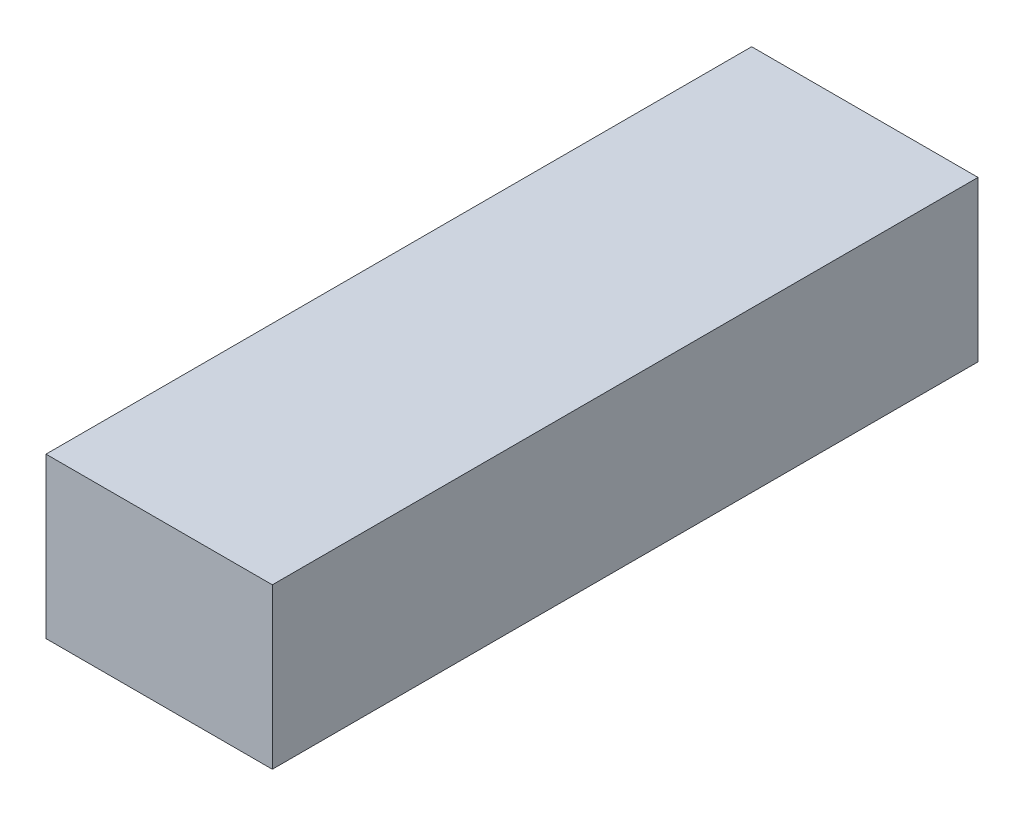
ISO-10303-21;
HEADER;
FILE_DESCRIPTION(('STEP AP214'),'2;1');
FILE_NAME('part.step','',(''),(''),'','','');
FILE_SCHEMA(('AUTOMOTIVE_DESIGN { 1 0 10303 214 1 1 1 1 }'));
ENDSEC;
DATA;
#1=APPLICATION_CONTEXT('core data for automotive mechanical design processes');
#2=APPLICATION_PROTOCOL_DEFINITION('international standard','automotive_design',2000,#1);
#3=PRODUCT_CONTEXT('',#1,'mechanical');
#4=PRODUCT('Part','Part','',(#3));
#5=PRODUCT_RELATED_PRODUCT_CATEGORY('part','',(#4));
#6=PRODUCT_DEFINITION_FORMATION('','',#4);
#7=PRODUCT_DEFINITION_CONTEXT('part definition',#1,'design');
#8=PRODUCT_DEFINITION('design','',#6,#7);
#9=PRODUCT_DEFINITION_SHAPE('','',#8);
#10=(LENGTH_UNIT() NAMED_UNIT(*) SI_UNIT(.MILLI.,.METRE.));
#11=(NAMED_UNIT(*) PLANE_ANGLE_UNIT() SI_UNIT($,.RADIAN.));
#12=(NAMED_UNIT(*) SI_UNIT($,.STERADIAN.) SOLID_ANGLE_UNIT());
#13=UNCERTAINTY_MEASURE_WITH_UNIT(LENGTH_MEASURE(1.E-05),#10,'distance_accuracy_value','');
#14=(GEOMETRIC_REPRESENTATION_CONTEXT(3) GLOBAL_UNCERTAINTY_ASSIGNED_CONTEXT((#13)) GLOBAL_UNIT_ASSIGNED_CONTEXT((#10,
#11,#12)) REPRESENTATION_CONTEXT('',''));
#15=CARTESIAN_POINT('',(0.,0.,0.));
#16=DIRECTION('',(0.,0.,1.));
#17=DIRECTION('',(1.,0.,0.));
#18=AXIS2_PLACEMENT_3D('',#15,#16,#17);
#19=CARTESIAN_POINT('',(17.,24.,53.));
#20=DIRECTION('',(-1.,0.,0.));
#21=DIRECTION('',(0.,0.,1.));
#22=AXIS2_PLACEMENT_3D('',#19,#20,#21);
#23=PLANE('',#22);
#24=DIRECTION('',(0.,0.,-1.));
#25=VECTOR('',#24,1.);
#26=CARTESIAN_POINT('',(17.,0.,53.));
#27=LINE('',#26,#25);
#28=CARTESIAN_POINT('',(17.,0.,53.));
#29=VERTEX_POINT('',#28);
#30=CARTESIAN_POINT('',(17.,0.,-53.));
#31=VERTEX_POINT('',#30);
#32=EDGE_CURVE('E96',#29,#31,#27,.T.);
#33=ORIENTED_EDGE('',*,*,#32,.T.);
#34=DIRECTION('',(0.,-1.,0.));
#35=VECTOR('',#34,1.);
#36=CARTESIAN_POINT('',(17.,24.,-53.));
#37=LINE('',#36,#35);
#38=CARTESIAN_POINT('',(17.,24.,-53.));
#39=VERTEX_POINT('',#38);
#40=EDGE_CURVE('E11',#39,#31,#37,.T.);
#41=ORIENTED_EDGE('',*,*,#40,.F.);
#42=DIRECTION('',(0.,0.,-1.));
#43=VECTOR('',#42,1.);
#44=CARTESIAN_POINT('',(17.,24.,53.));
#45=LINE('',#44,#43);
#46=CARTESIAN_POINT('',(17.,24.,53.));
#47=VERTEX_POINT('',#46);
#48=EDGE_CURVE('E84',#47,#39,#45,.T.);
#49=ORIENTED_EDGE('',*,*,#48,.F.);
#50=DIRECTION('',(0.,-1.,0.));
#51=VECTOR('',#50,1.);
#52=CARTESIAN_POINT('',(17.,24.,53.));
#53=LINE('',#52,#51);
#54=EDGE_CURVE('E92',#47,#29,#53,.T.);
#55=ORIENTED_EDGE('',*,*,#54,.T.);
#56=EDGE_LOOP('',(#33,#41,#49,#55));
#57=FACE_BOUND('',#56,.T.);
#58=ADVANCED_FACE('F33',(#57),#23,.F.);
#59=CARTESIAN_POINT('',(-17.,24.,-53.));
#60=DIRECTION('',(0.,0.,1.));
#61=DIRECTION('',(1.,0.,0.));
#62=AXIS2_PLACEMENT_3D('',#59,#60,#61);
#63=PLANE('',#62);
#64=DIRECTION('',(-1.,0.,0.));
#65=VECTOR('',#64,1.);
#66=CARTESIAN_POINT('',(-17.,0.,-53.));
#67=LINE('',#66,#65);
#68=CARTESIAN_POINT('',(-17.,0.,-53.));
#69=VERTEX_POINT('',#68);
#70=EDGE_CURVE('E88',#31,#69,#67,.T.);
#71=ORIENTED_EDGE('',*,*,#70,.T.);
#72=DIRECTION('',(0.,-1.,0.));
#73=VECTOR('',#72,1.);
#74=CARTESIAN_POINT('',(-17.,24.,-53.));
#75=LINE('',#74,#73);
#76=CARTESIAN_POINT('',(-17.,24.,-53.));
#77=VERTEX_POINT('',#76);
#78=EDGE_CURVE('E41',#77,#69,#75,.T.);
#79=ORIENTED_EDGE('',*,*,#78,.F.);
#80=DIRECTION('',(-1.,0.,0.));
#81=VECTOR('',#80,1.);
#82=CARTESIAN_POINT('',(-17.,24.,-53.));
#83=LINE('',#82,#81);
#84=EDGE_CURVE('E79',#39,#77,#83,.T.);
#85=ORIENTED_EDGE('',*,*,#84,.F.);
#86=ORIENTED_EDGE('',*,*,#40,.T.);
#87=EDGE_LOOP('',(#71,#79,#85,#86));
#88=FACE_BOUND('',#87,.T.);
#89=ADVANCED_FACE('F87',(#88),#63,.F.);
#90=CARTESIAN_POINT('',(-17.,24.,53.));
#91=DIRECTION('',(1.,0.,0.));
#92=DIRECTION('',(0.,0.,-1.));
#93=AXIS2_PLACEMENT_3D('',#90,#91,#92);
#94=PLANE('',#93);
#95=DIRECTION('',(0.,0.,1.));
#96=VECTOR('',#95,1.);
#97=CARTESIAN_POINT('',(-17.,0.,53.));
#98=LINE('',#97,#96);
#99=CARTESIAN_POINT('',(-17.,0.,53.));
#100=VERTEX_POINT('',#99);
#101=EDGE_CURVE('E66',#69,#100,#98,.T.);
#102=ORIENTED_EDGE('',*,*,#101,.T.);
#103=DIRECTION('',(0.,-1.,0.));
#104=VECTOR('',#103,1.);
#105=CARTESIAN_POINT('',(-17.,24.,53.));
#106=LINE('',#105,#104);
#107=CARTESIAN_POINT('',(-17.,24.,53.));
#108=VERTEX_POINT('',#107);
#109=EDGE_CURVE('E89',#108,#100,#106,.T.);
#110=ORIENTED_EDGE('',*,*,#109,.F.);
#111=DIRECTION('',(0.,0.,1.));
#112=VECTOR('',#111,1.);
#113=CARTESIAN_POINT('',(-17.,24.,53.));
#114=LINE('',#113,#112);
#115=EDGE_CURVE('E82',#77,#108,#114,.T.);
#116=ORIENTED_EDGE('',*,*,#115,.F.);
#117=ORIENTED_EDGE('',*,*,#78,.T.);
#118=EDGE_LOOP('',(#102,#110,#116,#117));
#119=FACE_BOUND('',#118,.T.);
#120=ADVANCED_FACE('F90',(#119),#94,.F.);
#121=CARTESIAN_POINT('',(-17.,24.,53.));
#122=DIRECTION('',(0.,0.,-1.));
#123=DIRECTION('',(-1.,0.,0.));
#124=AXIS2_PLACEMENT_3D('',#121,#122,#123);
#125=PLANE('',#124);
#126=DIRECTION('',(1.,0.,0.));
#127=VECTOR('',#126,1.);
#128=CARTESIAN_POINT('',(-17.,0.,53.));
#129=LINE('',#128,#127);
#130=EDGE_CURVE('E72',#100,#29,#129,.T.);
#131=ORIENTED_EDGE('',*,*,#130,.T.);
#132=ORIENTED_EDGE('',*,*,#54,.F.);
#133=DIRECTION('',(1.,0.,0.));
#134=VECTOR('',#133,1.);
#135=CARTESIAN_POINT('',(-17.,24.,53.));
#136=LINE('',#135,#134);
#137=EDGE_CURVE('E49',#108,#47,#136,.T.);
#138=ORIENTED_EDGE('',*,*,#137,.F.);
#139=ORIENTED_EDGE('',*,*,#109,.T.);
#140=EDGE_LOOP('',(#131,#132,#138,#139));
#141=FACE_BOUND('',#140,.T.);
#142=ADVANCED_FACE('F103',(#141),#125,.F.);
#143=CARTESIAN_POINT('',(0.,24.,0.));
#144=DIRECTION('',(0.,-1.,0.));
#145=DIRECTION('',(0.,0.,-1.));
#146=AXIS2_PLACEMENT_3D('',#143,#144,#145);
#147=PLANE('',#146);
#148=ORIENTED_EDGE('',*,*,#48,.T.);
#149=ORIENTED_EDGE('',*,*,#84,.T.);
#150=ORIENTED_EDGE('',*,*,#115,.T.);
#151=ORIENTED_EDGE('',*,*,#137,.T.);
#152=EDGE_LOOP('',(#148,#149,#150,#151));
#153=FACE_BOUND('',#152,.T.);
#154=ADVANCED_FACE('F80',(#153),#147,.F.);
#155=CARTESIAN_POINT('',(0.,0.,0.));
#156=DIRECTION('',(0.,-1.,0.));
#157=DIRECTION('',(0.,0.,-1.));
#158=AXIS2_PLACEMENT_3D('',#155,#156,#157);
#159=PLANE('',#158);
#160=ORIENTED_EDGE('',*,*,#32,.F.);
#161=ORIENTED_EDGE('',*,*,#130,.F.);
#162=ORIENTED_EDGE('',*,*,#101,.F.);
#163=ORIENTED_EDGE('',*,*,#70,.F.);
#164=EDGE_LOOP('',(#160,#161,#162,#163));
#165=FACE_BOUND('',#164,.T.);
#166=ADVANCED_FACE('F106',(#165),#159,.T.);
#167=CLOSED_SHELL('',(#58,#89,#120,#142,#154,#166));
#168=MANIFOLD_SOLID_BREP('B2',#167);
#169=ADVANCED_BREP_SHAPE_REPRESENTATION('',(#18,#168),#14);
#170=SHAPE_DEFINITION_REPRESENTATION(#9,#169);
ENDSEC;
END-ISO-10303-21;
